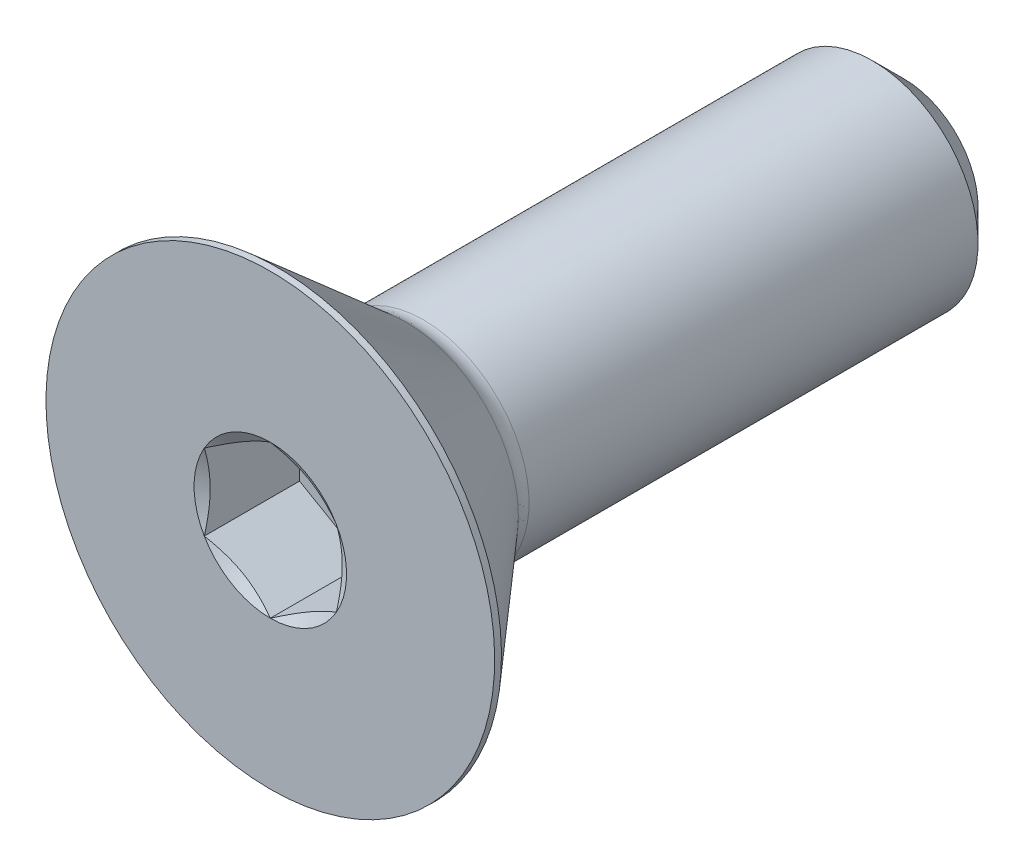
ISO-10303-21;
HEADER;
FILE_DESCRIPTION(('STEP AP214'),'2;1');
FILE_NAME('part.step','',(''),(''),'','','');
FILE_SCHEMA(('AUTOMOTIVE_DESIGN { 1 0 10303 214 1 1 1 1 }'));
ENDSEC;
DATA;
#1=APPLICATION_CONTEXT('core data for automotive mechanical design processes');
#2=APPLICATION_PROTOCOL_DEFINITION('international standard','automotive_design',2000,#1);
#3=PRODUCT_CONTEXT('',#1,'mechanical');
#4=PRODUCT('Part','Part','',(#3));
#5=PRODUCT_RELATED_PRODUCT_CATEGORY('part','',(#4));
#6=PRODUCT_DEFINITION_FORMATION('','',#4);
#7=PRODUCT_DEFINITION_CONTEXT('part definition',#1,'design');
#8=PRODUCT_DEFINITION('design','',#6,#7);
#9=PRODUCT_DEFINITION_SHAPE('','',#8);
#10=(LENGTH_UNIT() NAMED_UNIT(*) SI_UNIT(.MILLI.,.METRE.));
#11=(NAMED_UNIT(*) PLANE_ANGLE_UNIT() SI_UNIT($,.RADIAN.));
#12=(NAMED_UNIT(*) SI_UNIT($,.STERADIAN.) SOLID_ANGLE_UNIT());
#13=UNCERTAINTY_MEASURE_WITH_UNIT(LENGTH_MEASURE(1.E-05),#10,'distance_accuracy_value','');
#14=(GEOMETRIC_REPRESENTATION_CONTEXT(3) GLOBAL_UNCERTAINTY_ASSIGNED_CONTEXT((#13)) GLOBAL_UNIT_ASSIGNED_CONTEXT((#10,
#11,#12)) REPRESENTATION_CONTEXT('',''));
#15=CARTESIAN_POINT('',(0.,0.,0.));
#16=DIRECTION('',(0.,0.,1.));
#17=DIRECTION('',(1.,0.,0.));
#18=AXIS2_PLACEMENT_3D('',#15,#16,#17);
#19=CARTESIAN_POINT('',(0.,0.,-19.05));
#20=DIRECTION('',(0.,0.,-1.));
#21=DIRECTION('',(0.,1.,0.));
#22=AXIS2_PLACEMENT_3D('',#19,#20,#21);
#23=CYLINDRICAL_SURFACE('',#22,3.175);
#24=CARTESIAN_POINT('',(0.,0.,-18.0975));
#25=DIRECTION('',(0.,0.,-1.));
#26=DIRECTION('',(0.,1.,0.));
#27=AXIS2_PLACEMENT_3D('',#24,#25,#26);
#28=CIRCLE('',#27,3.175);
#29=CARTESIAN_POINT('',(0.,3.175,-18.0975));
#30=VERTEX_POINT('',#29);
#31=EDGE_CURVE('E50',#30,#30,#28,.F.);
#32=ORIENTED_EDGE('',*,*,#31,.T.);
#33=EDGE_LOOP('',(#32));
#34=FACE_BOUND('',#33,.T.);
#35=CARTESIAN_POINT('',(0.,0.,-4.60180899712602));
#36=DIRECTION('',(0.,0.,1.));
#37=DIRECTION('',(0.,-1.,0.));
#38=AXIS2_PLACEMENT_3D('',#35,#36,#37);
#39=CIRCLE('',#38,3.175);
#40=CARTESIAN_POINT('',(0.,-3.175,-4.60180899712602));
#41=VERTEX_POINT('',#40);
#42=EDGE_CURVE('E213',#41,#41,#39,.T.);
#43=ORIENTED_EDGE('',*,*,#42,.F.);
#44=EDGE_LOOP('',(#43));
#45=FACE_BOUND('',#44,.T.);
#46=ADVANCED_FACE('F36',(#34,#45),#23,.T.);
#47=CARTESIAN_POINT('',(0.,-3.175,-19.05));
#48=DIRECTION('',(0.,0.,-1.));
#49=DIRECTION('',(0.,1.,0.));
#50=AXIS2_PLACEMENT_3D('',#47,#48,#49);
#51=PLANE('',#50);
#52=CARTESIAN_POINT('',(0.,0.,-19.05));
#53=DIRECTION('',(0.,0.,-1.));
#54=DIRECTION('',(0.,1.,0.));
#55=AXIS2_PLACEMENT_3D('',#52,#53,#54);
#56=CIRCLE('',#55,2.2225);
#57=CARTESIAN_POINT('',(0.,2.2225,-19.05));
#58=VERTEX_POINT('',#57);
#59=EDGE_CURVE('E216',#58,#58,#56,.T.);
#60=ORIENTED_EDGE('',*,*,#59,.T.);
#61=EDGE_LOOP('',(#60));
#62=FACE_BOUND('',#61,.T.);
#63=ADVANCED_FACE('F226',(#62),#51,.T.);
#64=CARTESIAN_POINT('',(0.,0.,-19.05));
#65=DIRECTION('',(0.,0.,1.));
#66=DIRECTION('',(0.,-1.,0.));
#67=AXIS2_PLACEMENT_3D('',#64,#65,#66);
#68=CONICAL_SURFACE('',#67,2.2225,0.785398163397445);
#69=ORIENTED_EDGE('',*,*,#31,.F.);
#70=EDGE_LOOP('',(#69));
#71=FACE_BOUND('',#70,.T.);
#72=ORIENTED_EDGE('',*,*,#59,.F.);
#73=EDGE_LOOP('',(#72));
#74=FACE_BOUND('',#73,.T.);
#75=ADVANCED_FACE('F38',(#71,#74),#68,.T.);
#76=CARTESIAN_POINT('',(0.,0.,-4.60180899712602));
#77=DIRECTION('',(0.,0.,1.));
#78=DIRECTION('',(0.,-1.,0.));
#79=AXIS2_PLACEMENT_3D('',#76,#77,#78);
#80=TOROIDAL_SURFACE('',#79,3.95604099552517,0.781040995525163);
#81=CARTESIAN_POINT('',(0.,0.,-4.0894));
#82=DIRECTION('',(0.,0.,1.));
#83=DIRECTION('',(0.,-1.,0.));
#84=AXIS2_PLACEMENT_3D('',#81,#82,#83);
#85=CIRCLE('',#84,3.36658187365559);
#86=CARTESIAN_POINT('',(0.,-3.36658187365559,-4.0894));
#87=VERTEX_POINT('',#86);
#88=EDGE_CURVE('E210',#87,#87,#85,.T.);
#89=ORIENTED_EDGE('',*,*,#88,.F.);
#90=EDGE_LOOP('',(#89));
#91=FACE_BOUND('',#90,.T.);
#92=ORIENTED_EDGE('',*,*,#42,.T.);
#93=EDGE_LOOP('',(#92));
#94=FACE_BOUND('',#93,.T.);
#95=ADVANCED_FACE('F225',(#91,#94),#80,.F.);
#96=CARTESIAN_POINT('',(0.,0.,-4.0894));
#97=DIRECTION('',(0.,0.,1.));
#98=DIRECTION('',(0.,-1.,0.));
#99=AXIS2_PLACEMENT_3D('',#96,#97,#98);
#100=CONICAL_SURFACE('',#99,3.36658187365559,0.715584993317677);
#101=CARTESIAN_POINT('',(0.,0.,-0.204469999999999));
#102=DIRECTION('',(0.,0.,1.));
#103=DIRECTION('',(0.,-1.,0.));
#104=AXIS2_PLACEMENT_3D('',#101,#102,#103);
#105=CIRCLE('',#104,6.7437);
#106=CARTESIAN_POINT('',(0.,-6.7437,-0.204469999999999));
#107=VERTEX_POINT('',#106);
#108=EDGE_CURVE('E207',#107,#107,#105,.T.);
#109=ORIENTED_EDGE('',*,*,#108,.F.);
#110=EDGE_LOOP('',(#109));
#111=FACE_BOUND('',#110,.T.);
#112=ORIENTED_EDGE('',*,*,#88,.T.);
#113=EDGE_LOOP('',(#112));
#114=FACE_BOUND('',#113,.T.);
#115=ADVANCED_FACE('F238',(#111,#114),#100,.T.);
#116=CARTESIAN_POINT('',(0.,0.,0.));
#117=DIRECTION('',(0.,0.,1.));
#118=DIRECTION('',(0.,-1.,0.));
#119=AXIS2_PLACEMENT_3D('',#116,#117,#118);
#120=CYLINDRICAL_SURFACE('',#119,6.7437);
#121=CARTESIAN_POINT('',(0.,0.,0.));
#122=DIRECTION('',(0.,0.,1.));
#123=DIRECTION('',(0.,-1.,0.));
#124=AXIS2_PLACEMENT_3D('',#121,#122,#123);
#125=CIRCLE('',#124,6.7437);
#126=CARTESIAN_POINT('',(0.,-6.7437,0.));
#127=VERTEX_POINT('',#126);
#128=EDGE_CURVE('E195',#127,#127,#125,.T.);
#129=ORIENTED_EDGE('',*,*,#128,.F.);
#130=EDGE_LOOP('',(#129));
#131=FACE_BOUND('',#130,.T.);
#132=ORIENTED_EDGE('',*,*,#108,.T.);
#133=EDGE_LOOP('',(#132));
#134=FACE_BOUND('',#133,.T.);
#135=ADVANCED_FACE('F168',(#131,#134),#120,.T.);
#136=CARTESIAN_POINT('',(0.,-3.175,0.));
#137=DIRECTION('',(0.,0.,1.));
#138=DIRECTION('',(0.,-1.,0.));
#139=AXIS2_PLACEMENT_3D('',#136,#137,#138);
#140=PLANE('',#139);
#141=CARTESIAN_POINT('',(0.,0.,0.));
#142=DIRECTION('',(0.,0.,1.));
#143=DIRECTION('',(1.,0.,0.));
#144=AXIS2_PLACEMENT_3D('',#141,#142,#143);
#145=CIRCLE('',#144,2.29135888084633);
#146=CARTESIAN_POINT('',(0.,-2.29135888084633,0.));
#147=VERTEX_POINT('',#146);
#148=CARTESIAN_POINT('',(1.984375,-1.14567944042316,0.));
#149=VERTEX_POINT('',#148);
#150=EDGE_CURVE('E63',#147,#149,#145,.T.);
#151=ORIENTED_EDGE('',*,*,#150,.F.);
#152=CARTESIAN_POINT('',(-1.984375,-1.14567944042316,0.));
#153=VERTEX_POINT('',#152);
#154=EDGE_CURVE('E135',#153,#147,#145,.T.);
#155=ORIENTED_EDGE('',*,*,#154,.F.);
#156=CARTESIAN_POINT('',(-1.984375,1.14567944042317,0.));
#157=VERTEX_POINT('',#156);
#158=EDGE_CURVE('E134',#157,#153,#145,.T.);
#159=ORIENTED_EDGE('',*,*,#158,.F.);
#160=CARTESIAN_POINT('',(0.,2.29135888084633,0.));
#161=VERTEX_POINT('',#160);
#162=EDGE_CURVE('E104',#161,#157,#145,.T.);
#163=ORIENTED_EDGE('',*,*,#162,.F.);
#164=CARTESIAN_POINT('',(1.984375,1.14567944042316,0.));
#165=VERTEX_POINT('',#164);
#166=EDGE_CURVE('E95',#165,#161,#145,.T.);
#167=ORIENTED_EDGE('',*,*,#166,.F.);
#168=EDGE_CURVE('E56',#149,#165,#145,.T.);
#169=ORIENTED_EDGE('',*,*,#168,.F.);
#170=EDGE_LOOP('',(#151,#155,#159,#163,#167,#169));
#171=FACE_BOUND('',#170,.T.);
#172=ORIENTED_EDGE('',*,*,#128,.T.);
#173=EDGE_LOOP('',(#172));
#174=FACE_BOUND('',#173,.T.);
#175=ADVANCED_FACE('F130',(#171,#174),#140,.T.);
#176=CARTESIAN_POINT('',(0.,0.,0.));
#177=DIRECTION('',(0.,0.,1.));
#178=DIRECTION('',(1.,0.,0.));
#179=AXIS2_PLACEMENT_3D('',#176,#177,#178);
#180=CONICAL_SURFACE('',#179,2.29135888084633,1.0471975511966);
#181=ORIENTED_EDGE('',*,*,#162,.T.);
#182=CARTESIAN_POINT('',(0.000199999999999609,2.29147435090017,6.66717057831416E-05));
#183=CARTESIAN_POINT('',(-0.0870046387806768,2.24112672922556,-0.029014317759813));
#184=CARTESIAN_POINT('',(-0.174962019304997,2.19034451190263,-0.0554627919729485));
#185=CARTESIAN_POINT('',(-0.35239997867232,2.08790065829745,-0.101629728793529));
#186=CARTESIAN_POINT('',(-0.441883711256319,2.03623720120198,-0.121331857751036));
#187=CARTESIAN_POINT('',(-0.619742148012469,1.93355058486317,-0.152002268068471));
#188=CARTESIAN_POINT('',(-0.708089480306094,1.88254322878126,-0.163174657279787));
#189=CARTESIAN_POINT('',(-0.88520002811095,1.78028840632981,-0.176514203945575));
#190=CARTESIAN_POINT('',(-0.973962599510547,1.72904131183829,-0.178692405539878));
#191=CARTESIAN_POINT('',(-1.13983230286466,1.63327639395638,-0.174170448491651));
#192=CARTESIAN_POINT('',(-1.21696421566591,1.58874426333747,-0.168580586544127));
#193=CARTESIAN_POINT('',(-1.37072550718908,1.49997014028563,-0.150861066102989));
#194=CARTESIAN_POINT('',(-1.44735435374552,1.45572845509857,-0.138725349670475));
#195=CARTESIAN_POINT('',(-1.60143288850678,1.36677117157782,-0.108385841155635));
#196=CARTESIAN_POINT('',(-1.67886306721268,1.32206683705857,-0.09005339070901));
#197=CARTESIAN_POINT('',(-1.83256831124359,1.23332507304146,-0.0484454935998176));
#198=CARTESIAN_POINT('',(-1.90884534705293,1.18928650588395,-0.0251798287176209));
#199=CARTESIAN_POINT('',(-1.984575,1.14556397036933,6.66717057829762E-05));
#200=B_SPLINE_CURVE_WITH_KNOTS('',3,(#182,#183,#184,#185,#186,#187,#188,#189,#190,#191,#192,
#193,#194,#195,#196,#197,#198,#199),.UNSPECIFIED.,.F.,.F.,(4,2,2,2,2,2,2,2,4),(0.,
0.314555137114086,0.629866549668806,0.937373439505933,1.24450262309398,1.51196650590478,
1.77967834211415,2.05332989762155,2.32644383656793),.UNSPECIFIED.);
#201=EDGE_CURVE('E11',#161,#157,#200,.T.);
#202=ORIENTED_EDGE('',*,*,#201,.F.);
#203=EDGE_LOOP('',(#181,#202));
#204=FACE_BOUND('',#203,.T.);
#205=ADVANCED_FACE('F108',(#204),#180,.F.);
#206=ORIENTED_EDGE('',*,*,#158,.T.);
#207=CARTESIAN_POINT('',(-1.984375,-2.96692860034507,0.737860651092377));
#208=CARTESIAN_POINT('',(-1.984375,-2.88123645369667,0.69674880177529));
#209=CARTESIAN_POINT('',(-1.984375,-2.79533554929687,0.656063972956056));
#210=CARTESIAN_POINT('',(-1.984375,-2.62300496253372,0.575790597945192));
#211=CARTESIAN_POINT('',(-1.984375,-2.53657518838115,0.536202249047077));
#212=CARTESIAN_POINT('',(-1.984375,-2.36258003650985,0.458142914429596));
#213=CARTESIAN_POINT('',(-1.984375,-2.27501095051754,0.419680163398946));
#214=CARTESIAN_POINT('',(-1.984375,-2.09913795632987,0.344479427097519));
#215=CARTESIAN_POINT('',(-1.984375,-2.01083408662377,0.307741352146445));
#216=CARTESIAN_POINT('',(-1.984375,-1.83102497893539,0.235513729354963));
#217=CARTESIAN_POINT('',(-1.984375,-1.73949640320228,0.200081939073892));
#218=CARTESIAN_POINT('',(-1.984375,-1.55533214713673,0.132164183556778));
#219=CARTESIAN_POINT('',(-1.984375,-1.46269633980312,0.0996785599926462));
#220=CARTESIAN_POINT('',(-1.984375,-1.27638419434466,0.0385821363592113));
#221=CARTESIAN_POINT('',(-1.984375,-1.18271082678456,0.00996237523819853));
#222=CARTESIAN_POINT('',(-1.984375,-0.994021652382587,-0.0424236311394211));
#223=CARTESIAN_POINT('',(-1.984375,-0.899006185229732,-0.0661910818015453));
#224=CARTESIAN_POINT('',(-1.984375,-0.70783051245842,-0.107605260619429));
#225=CARTESIAN_POINT('',(-1.984375,-0.611673084373239,-0.125264559933971));
#226=CARTESIAN_POINT('',(-1.984375,-0.418283092113672,-0.153306903466505));
#227=CARTESIAN_POINT('',(-1.984375,-0.32105060104525,-0.163690439394072));
#228=CARTESIAN_POINT('',(-1.984375,-0.127210752774483,-0.176214799009401));
#229=CARTESIAN_POINT('',(-1.984375,-0.0306098639781231,-0.178452892631436));
#230=CARTESIAN_POINT('',(-1.984375,0.162431915887106,-0.17475795296783));
#231=CARTESIAN_POINT('',(-1.984375,0.258872796678698,-0.168824413724938));
#232=CARTESIAN_POINT('',(-1.984375,0.496826477184735,-0.144624426308478));
#233=CARTESIAN_POINT('',(-1.984375,0.637878211825128,-0.121822779785831));
#234=CARTESIAN_POINT('',(-1.984375,0.91723870370253,-0.0630239757386336));
#235=CARTESIAN_POINT('',(-1.984375,1.05554394232965,-0.0270109144574765));
#236=CARTESIAN_POINT('',(-1.984375,1.26239464896717,0.0345082078903479));
#237=CARTESIAN_POINT('',(-1.984375,1.33200934564274,0.0565514264145546));
#238=CARTESIAN_POINT('',(-1.984375,1.47051409380588,0.102676986257499));
#239=CARTESIAN_POINT('',(-1.984375,1.53940456776433,0.126758055006123));
#240=CARTESIAN_POINT('',(-1.984375,1.67655293465251,0.176609588689456));
#241=CARTESIAN_POINT('',(-1.984375,1.74481093998431,0.202379746602285));
#242=CARTESIAN_POINT('',(-1.984375,1.88078910071683,0.255330712681564));
#243=CARTESIAN_POINT('',(-1.984375,1.94850916300286,0.282511759182964));
#244=CARTESIAN_POINT('',(-1.984375,2.12136731788458,0.353633623835928));
#245=CARTESIAN_POINT('',(-1.984375,2.22615977384556,0.398413596701326));
#246=CARTESIAN_POINT('',(-1.984375,2.43479837304527,0.490132195682473));
#247=CARTESIAN_POINT('',(-1.984375,2.5386444446916,0.537070983511256));
#248=CARTESIAN_POINT('',(-1.984375,2.84907841644385,0.680364561323518));
#249=CARTESIAN_POINT('',(-1.984375,3.05452739791262,0.77918187526435));
#250=CARTESIAN_POINT('',(-1.984375,3.46367014223902,0.980960885724764));
#251=CARTESIAN_POINT('',(-1.984375,3.66736143684958,1.08392752775299));
#252=CARTESIAN_POINT('',(-1.984375,4.07334844866211,1.29250841655482));
#253=CARTESIAN_POINT('',(-1.984375,4.27564433912763,1.39812232679349));
#254=CARTESIAN_POINT('',(-1.984375,4.66022184962415,1.60111933686162));
#255=CARTESIAN_POINT('',(-1.984375,4.84259034249047,1.69833842729249));
#256=CARTESIAN_POINT('',(-1.984375,5.20674070245669,1.89388432048827));
#257=CARTESIAN_POINT('',(-1.984375,5.38852254752481,1.99221116424656));
#258=CARTESIAN_POINT('',(-1.984375,5.75117247931181,2.18944361750704));
#259=CARTESIAN_POINT('',(-1.984375,5.93204171415673,2.2883471187779));
#260=CARTESIAN_POINT('',(-1.984375,6.29341450955436,2.48679783989033));
#261=CARTESIAN_POINT('',(-1.984375,6.47391808874828,2.5863450257738));
#262=CARTESIAN_POINT('',(-1.984375,6.6542902961452,2.6861282522634));
#263=B_SPLINE_CURVE_WITH_KNOTS('',3,(#207,#208,#209,#210,#211,#212,#213,#214,#215,#216,#217,
#218,#219,#220,#221,#222,#223,#224,#225,#226,#227,#228,#229,#230,#231,#232,#233,#234,#235,#236,
#237,#238,#239,#240,#241,#242,#243,#244,#245,#246,#247,#248,#249,#250,#251,#252,#253,#254,#255,
#256,#257,#258,#259,#260,#261,#262),.UNSPECIFIED.,.F.,.F.,(4,2,2,2,2,2,2,2,2,2,2,2,2,2,2,2,2,2,
2,2,2,2,2,2,2,2,2,4),(0.,0.285135519832373,0.570322016122788,0.857238463819792,1.14413997577449,
1.43854271801315,1.7329795590899,2.02672173491208,2.32039085060263,2.61345191984504,
2.90649318156653,3.19602335108128,3.48557144803805,3.91334047285799,4.34162614021154,
4.56066589824458,4.77956986852721,4.99843415889189,5.21733554208811,5.55917796423187,
5.90104603503021,6.58489509249957,7.26958483186157,7.95418796687477,8.57417425374278,
9.1941835596094,9.81261585701217,10.431015790458),.UNSPECIFIED.);
#264=EDGE_CURVE('E103',#157,#153,#263,.F.);
#265=ORIENTED_EDGE('',*,*,#264,.F.);
#266=EDGE_LOOP('',(#206,#265));
#267=FACE_BOUND('',#266,.T.);
#268=ADVANCED_FACE('F266',(#267),#180,.F.);
#269=ORIENTED_EDGE('',*,*,#154,.T.);
#270=CARTESIAN_POINT('',(-1.984575,-1.14556397036933,6.66717057829649E-05));
#271=CARTESIAN_POINT('',(-1.89737036121932,-1.19591159204393,-0.0290143177598132));
#272=CARTESIAN_POINT('',(-1.809412980695,-1.24669380936686,-0.0554627919729487));
#273=CARTESIAN_POINT('',(-1.63197502132768,-1.34913766297205,-0.101629728793529));
#274=CARTESIAN_POINT('',(-1.54249128874368,-1.40080112006751,-0.121331857751037));
#275=CARTESIAN_POINT('',(-1.36463285198753,-1.50348773640632,-0.152002268068471));
#276=CARTESIAN_POINT('',(-1.27628551969391,-1.55449509248823,-0.163174657279787));
#277=CARTESIAN_POINT('',(-1.09917497188905,-1.65674991493968,-0.176514203945575));
#278=CARTESIAN_POINT('',(-1.01041240048945,-1.70799700943121,-0.178692405539878));
#279=CARTESIAN_POINT('',(-0.844542697135338,-1.80376192731311,-0.174170448491652));
#280=CARTESIAN_POINT('',(-0.767410784334093,-1.84829405793202,-0.168580586544128));
#281=CARTESIAN_POINT('',(-0.613649492810919,-1.93706818098387,-0.150861066102989));
#282=CARTESIAN_POINT('',(-0.537020646254476,-1.98130986617092,-0.138725349670476));
#283=CARTESIAN_POINT('',(-0.382942111493217,-2.07026714969167,-0.108385841155636));
#284=CARTESIAN_POINT('',(-0.305511932787318,-2.11497148421093,-0.0900533907090107));
#285=CARTESIAN_POINT('',(-0.151806688756412,-2.20371324822803,-0.0484454935998183));
#286=CARTESIAN_POINT('',(-0.075529652947068,-2.24775181538554,-0.0251798287176216));
#287=CARTESIAN_POINT('',(0.000199999999999772,-2.29147435090016,6.66717057822253E-05));
#288=B_SPLINE_CURVE_WITH_KNOTS('',3,(#270,#271,#272,#273,#274,#275,#276,#277,#278,#279,#280,
#281,#282,#283,#284,#285,#286,#287),.UNSPECIFIED.,.F.,.F.,(4,2,2,2,2,2,2,2,4),(0.,
0.314555137114086,0.629866549668806,0.937373439505932,1.24450262309398,1.51196650590478,
1.77967834211415,2.05332989762155,2.32644383656793),.UNSPECIFIED.);
#289=EDGE_CURVE('E144',#153,#147,#288,.T.);
#290=ORIENTED_EDGE('',*,*,#289,.F.);
#291=EDGE_LOOP('',(#269,#290));
#292=FACE_BOUND('',#291,.T.);
#293=ADVANCED_FACE('F272',(#292),#180,.F.);
#294=ORIENTED_EDGE('',*,*,#150,.T.);
#295=CARTESIAN_POINT('',(-0.000200000000000051,-2.29147435090016,6.66717057826408E-05));
#296=CARTESIAN_POINT('',(0.0870046387806763,-2.24112672922556,-0.0290143177598132));
#297=CARTESIAN_POINT('',(0.174962019304996,-2.19034451190263,-0.0554627919729487));
#298=CARTESIAN_POINT('',(0.352399978672319,-2.08790065829744,-0.101629728793529));
#299=CARTESIAN_POINT('',(0.441883711256319,-2.03623720120198,-0.121331857751037));
#300=CARTESIAN_POINT('',(0.619742148012468,-1.93355058486317,-0.152002268068471));
#301=CARTESIAN_POINT('',(0.708089480306093,-1.88254322878126,-0.163174657279787));
#302=CARTESIAN_POINT('',(0.885200028110949,-1.78028840632981,-0.176514203945575));
#303=CARTESIAN_POINT('',(0.973962599510546,-1.72904131183829,-0.178692405539878));
#304=CARTESIAN_POINT('',(1.13983230286466,-1.63327639395638,-0.174170448491652));
#305=CARTESIAN_POINT('',(1.21696421566591,-1.58874426333747,-0.168580586544128));
#306=CARTESIAN_POINT('',(1.37072550718908,-1.49997014028563,-0.150861066102989));
#307=CARTESIAN_POINT('',(1.44735435374552,-1.45572845509857,-0.138725349670476));
#308=CARTESIAN_POINT('',(1.60143288850678,-1.36677117157782,-0.108385841155636));
#309=CARTESIAN_POINT('',(1.67886306721268,-1.32206683705856,-0.0900533907090105));
#310=CARTESIAN_POINT('',(1.83256831124359,-1.23332507304146,-0.0484454935998179));
#311=CARTESIAN_POINT('',(1.90884534705293,-1.18928650588395,-0.0251798287176211));
#312=CARTESIAN_POINT('',(1.984575,-1.14556397036933,6.66717057827258E-05));
#313=B_SPLINE_CURVE_WITH_KNOTS('',3,(#295,#296,#297,#298,#299,#300,#301,#302,#303,#304,#305,
#306,#307,#308,#309,#310,#311,#312),.UNSPECIFIED.,.F.,.F.,(4,2,2,2,2,2,2,2,4),(0.,
0.314555137114085,0.629866549668806,0.937373439505932,1.24450262309398,1.51196650590478,
1.77967834211415,2.05332989762155,2.32644383656793),.UNSPECIFIED.);
#314=EDGE_CURVE('E395',#147,#149,#313,.T.);
#315=ORIENTED_EDGE('',*,*,#314,.F.);
#316=EDGE_LOOP('',(#294,#315));
#317=FACE_BOUND('',#316,.T.);
#318=ADVANCED_FACE('F279',(#317),#180,.F.);
#319=ORIENTED_EDGE('',*,*,#168,.T.);
#320=CARTESIAN_POINT('',(1.984375,-2.96692860034507,0.737860651092378));
#321=CARTESIAN_POINT('',(1.984375,-2.88123645369666,0.69674880177529));
#322=CARTESIAN_POINT('',(1.984375,-2.79533554929687,0.656063972956056));
#323=CARTESIAN_POINT('',(1.984375,-2.62300496253372,0.575790597945192));
#324=CARTESIAN_POINT('',(1.984375,-2.53657518838115,0.536202249047077));
#325=CARTESIAN_POINT('',(1.984375,-2.36258003650985,0.458142914429596));
#326=CARTESIAN_POINT('',(1.984375,-2.27501095051754,0.419680163398946));
#327=CARTESIAN_POINT('',(1.984375,-2.09913795632987,0.344479427097519));
#328=CARTESIAN_POINT('',(1.984375,-2.01083408662377,0.307741352146445));
#329=CARTESIAN_POINT('',(1.984375,-1.83102497893539,0.235513729354964));
#330=CARTESIAN_POINT('',(1.984375,-1.73949640320228,0.200081939073892));
#331=CARTESIAN_POINT('',(1.984375,-1.55533214713673,0.132164183556778));
#332=CARTESIAN_POINT('',(1.984375,-1.46269633980312,0.0996785599926464));
#333=CARTESIAN_POINT('',(1.984375,-1.27638419434466,0.0385821363592116));
#334=CARTESIAN_POINT('',(1.984375,-1.18271082678456,0.00996237523819882));
#335=CARTESIAN_POINT('',(1.984375,-0.994021652382587,-0.042423631139421));
#336=CARTESIAN_POINT('',(1.984375,-0.899006185229731,-0.0661910818015453));
#337=CARTESIAN_POINT('',(1.984375,-0.70783051245842,-0.107605260619429));
#338=CARTESIAN_POINT('',(1.984375,-0.611673084373239,-0.125264559933971));
#339=CARTESIAN_POINT('',(1.984375,-0.418283092113671,-0.153306903466505));
#340=CARTESIAN_POINT('',(1.984375,-0.32105060104525,-0.163690439394072));
#341=CARTESIAN_POINT('',(1.984375,-0.127210752774482,-0.176214799009401));
#342=CARTESIAN_POINT('',(1.984375,-0.0306098639781227,-0.178452892631436));
#343=CARTESIAN_POINT('',(1.984375,0.162431915887107,-0.17475795296783));
#344=CARTESIAN_POINT('',(1.984375,0.258872796678699,-0.168824413724938));
#345=CARTESIAN_POINT('',(1.984375,0.496826477184735,-0.144624426308478));
#346=CARTESIAN_POINT('',(1.984375,0.637878211825129,-0.12182277978583));
#347=CARTESIAN_POINT('',(1.984375,0.91723870370253,-0.0630239757386333));
#348=CARTESIAN_POINT('',(1.984375,1.05554394232965,-0.0270109144574763));
#349=CARTESIAN_POINT('',(1.984375,1.26239464896717,0.0345082078903483));
#350=CARTESIAN_POINT('',(1.984375,1.33200934564274,0.0565514264145553));
#351=CARTESIAN_POINT('',(1.984375,1.47051409380588,0.1026769862575));
#352=CARTESIAN_POINT('',(1.984375,1.53940456776433,0.126758055006124));
#353=CARTESIAN_POINT('',(1.984375,1.67655293465251,0.176609588689457));
#354=CARTESIAN_POINT('',(1.984375,1.74481093998432,0.202379746602286));
#355=CARTESIAN_POINT('',(1.984375,1.88078910071683,0.255330712681565));
#356=CARTESIAN_POINT('',(1.984375,1.94850916300287,0.282511759182965));
#357=CARTESIAN_POINT('',(1.984375,2.12136731788458,0.353633623835929));
#358=CARTESIAN_POINT('',(1.984375,2.22615977384557,0.398413596701327));
#359=CARTESIAN_POINT('',(1.984375,2.43479837304527,0.490132195682473));
#360=CARTESIAN_POINT('',(1.984375,2.5386444446916,0.537070983511257));
#361=CARTESIAN_POINT('',(1.984375,2.84907841644385,0.680364561323519));
#362=CARTESIAN_POINT('',(1.984375,3.05452739791262,0.779181875264351));
#363=CARTESIAN_POINT('',(1.984375,3.46367014223902,0.980960885724765));
#364=CARTESIAN_POINT('',(1.984375,3.66736143684958,1.08392752775299));
#365=CARTESIAN_POINT('',(1.984375,4.07334844866211,1.29250841655482));
#366=CARTESIAN_POINT('',(1.984375,4.27564433912763,1.3981223267935));
#367=CARTESIAN_POINT('',(1.984375,4.66022184962416,1.60111933686162));
#368=CARTESIAN_POINT('',(1.984375,4.84259034249048,1.6983384272925));
#369=CARTESIAN_POINT('',(1.984375,5.2067407024567,1.89388432048827));
#370=CARTESIAN_POINT('',(1.984375,5.38852254752481,1.99221116424656));
#371=CARTESIAN_POINT('',(1.984375,5.75117247931181,2.18944361750704));
#372=CARTESIAN_POINT('',(1.984375,5.93204171415673,2.2883471187779));
#373=CARTESIAN_POINT('',(1.984375,6.29341450955436,2.48679783989034));
#374=CARTESIAN_POINT('',(1.984375,6.47391808874828,2.5863450257738));
#375=CARTESIAN_POINT('',(1.984375,6.6542902961452,2.6861282522634));
#376=B_SPLINE_CURVE_WITH_KNOTS('',3,(#320,#321,#322,#323,#324,#325,#326,#327,#328,#329,#330,
#331,#332,#333,#334,#335,#336,#337,#338,#339,#340,#341,#342,#343,#344,#345,#346,#347,#348,#349,
#350,#351,#352,#353,#354,#355,#356,#357,#358,#359,#360,#361,#362,#363,#364,#365,#366,#367,#368,
#369,#370,#371,#372,#373,#374,#375),.UNSPECIFIED.,.F.,.F.,(4,2,2,2,2,2,2,2,2,2,2,2,2,2,2,2,2,2,
2,2,2,2,2,2,2,2,2,4),(0.,0.285135519832374,0.570322016122787,0.857238463819791,1.14413997577449,
1.43854271801315,1.7329795590899,2.02672173491208,2.32039085060263,2.61345191984504,
2.90649318156653,3.19602335108128,3.48557144803805,3.91334047285799,4.34162614021154,
4.56066589824458,4.77956986852721,4.9984341588919,5.21733554208812,5.55917796423187,
5.90104603503021,6.58489509249957,7.26958483186157,7.95418796687478,8.57417425374278,
9.1941835596094,9.81261585701217,10.431015790458),.UNSPECIFIED.);
#377=EDGE_CURVE('E120',#149,#165,#376,.T.);
#378=ORIENTED_EDGE('',*,*,#377,.F.);
#379=EDGE_LOOP('',(#319,#378));
#380=FACE_BOUND('',#379,.T.);
#381=ADVANCED_FACE('F286',(#380),#180,.F.);
#382=ORIENTED_EDGE('',*,*,#166,.T.);
#383=CARTESIAN_POINT('',(1.984575,1.14556397036933,6.66717057832154E-05));
#384=CARTESIAN_POINT('',(1.89737036121932,1.19591159204393,-0.029014317759813));
#385=CARTESIAN_POINT('',(1.809412980695,1.24669380936687,-0.0554627919729485));
#386=CARTESIAN_POINT('',(1.63197502132768,1.34913766297205,-0.101629728793529));
#387=CARTESIAN_POINT('',(1.54249128874368,1.40080112006751,-0.121331857751036));
#388=CARTESIAN_POINT('',(1.36463285198753,1.50348773640632,-0.152002268068471));
#389=CARTESIAN_POINT('',(1.27628551969391,1.55449509248823,-0.163174657279786));
#390=CARTESIAN_POINT('',(1.09917497188905,1.65674991493969,-0.176514203945575));
#391=CARTESIAN_POINT('',(1.01041240048945,1.70799700943121,-0.178692405539878));
#392=CARTESIAN_POINT('',(0.844542697135338,1.80376192731311,-0.174170448491651));
#393=CARTESIAN_POINT('',(0.767410784334093,1.84829405793202,-0.168580586544127));
#394=CARTESIAN_POINT('',(0.613649492810919,1.93706818098387,-0.150861066102989));
#395=CARTESIAN_POINT('',(0.537020646254476,1.98130986617092,-0.138725349670475));
#396=CARTESIAN_POINT('',(0.382942111493217,2.07026714969167,-0.108385841155635));
#397=CARTESIAN_POINT('',(0.305511932787317,2.11497148421093,-0.0900533907090102));
#398=CARTESIAN_POINT('',(0.151806688756411,2.20371324822803,-0.0484454935998178));
#399=CARTESIAN_POINT('',(0.0755296529470672,2.24775181538554,-0.0251798287176211));
#400=CARTESIAN_POINT('',(-0.000200000000000537,2.29147435090017,6.6671705782726E-05));
#401=B_SPLINE_CURVE_WITH_KNOTS('',3,(#383,#384,#385,#386,#387,#388,#389,#390,#391,#392,#393,
#394,#395,#396,#397,#398,#399,#400),.UNSPECIFIED.,.F.,.F.,(4,2,2,2,2,2,2,2,4),(0.,
0.314555137114086,0.629866549668806,0.937373439505933,1.24450262309398,1.51196650590478,
1.77967834211415,2.05332989762155,2.32644383656793),.UNSPECIFIED.);
#402=EDGE_CURVE('E99',#165,#161,#401,.T.);
#403=ORIENTED_EDGE('',*,*,#402,.F.);
#404=EDGE_LOOP('',(#382,#403));
#405=FACE_BOUND('',#404,.T.);
#406=ADVANCED_FACE('F97',(#405),#180,.F.);
#407=CARTESIAN_POINT('',(0.,2.29135888084633,-2.86258));
#408=DIRECTION('',(0.,0.,1.));
#409=DIRECTION('',(1.,0.,0.));
#410=AXIS2_PLACEMENT_3D('',#407,#408,#409);
#411=PLANE('',#410);
#412=DIRECTION('',(-0.866025403784439,0.5,0.));
#413=VECTOR('',#412,1.);
#414=CARTESIAN_POINT('',(1.984375,1.14567944042317,-2.86258));
#415=LINE('',#414,#413);
#416=CARTESIAN_POINT('',(1.984375,1.14567944042317,-2.86258));
#417=VERTEX_POINT('',#416);
#418=CARTESIAN_POINT('',(0.,2.29135888084633,-2.86258));
#419=VERTEX_POINT('',#418);
#420=EDGE_CURVE('E119',#417,#419,#415,.T.);
#421=ORIENTED_EDGE('',*,*,#420,.T.);
#422=DIRECTION('',(-0.866025403784439,-0.5,0.));
#423=VECTOR('',#422,1.);
#424=CARTESIAN_POINT('',(0.,2.29135888084633,-2.86258));
#425=LINE('',#424,#423);
#426=CARTESIAN_POINT('',(-1.984375,1.14567944042316,-2.86258));
#427=VERTEX_POINT('',#426);
#428=EDGE_CURVE('E124',#419,#427,#425,.T.);
#429=ORIENTED_EDGE('',*,*,#428,.T.);
#430=DIRECTION('',(0.,-1.,0.));
#431=VECTOR('',#430,1.);
#432=CARTESIAN_POINT('',(-1.984375,1.14567944042316,-2.86258));
#433=LINE('',#432,#431);
#434=CARTESIAN_POINT('',(-1.984375,-1.14567944042316,-2.86258));
#435=VERTEX_POINT('',#434);
#436=EDGE_CURVE('E183',#427,#435,#433,.T.);
#437=ORIENTED_EDGE('',*,*,#436,.T.);
#438=DIRECTION('',(0.866025403784439,-0.5,0.));
#439=VECTOR('',#438,1.);
#440=CARTESIAN_POINT('',(-1.984375,-1.14567944042316,-2.86258));
#441=LINE('',#440,#439);
#442=CARTESIAN_POINT('',(0.,-2.29135888084633,-2.86258));
#443=VERTEX_POINT('',#442);
#444=EDGE_CURVE('E186',#435,#443,#441,.T.);
#445=ORIENTED_EDGE('',*,*,#444,.T.);
#446=DIRECTION('',(0.866025403784439,0.5,0.));
#447=VECTOR('',#446,1.);
#448=CARTESIAN_POINT('',(0.,-2.29135888084633,-2.86258));
#449=LINE('',#448,#447);
#450=CARTESIAN_POINT('',(1.984375,-1.14567944042316,-2.86258));
#451=VERTEX_POINT('',#450);
#452=EDGE_CURVE('E189',#443,#451,#449,.T.);
#453=ORIENTED_EDGE('',*,*,#452,.T.);
#454=DIRECTION('',(0.,1.,0.));
#455=VECTOR('',#454,1.);
#456=CARTESIAN_POINT('',(1.984375,-1.14567944042316,-2.86258));
#457=LINE('',#456,#455);
#458=EDGE_CURVE('E127',#451,#417,#457,.T.);
#459=ORIENTED_EDGE('',*,*,#458,.T.);
#460=EDGE_LOOP('',(#421,#429,#437,#445,#453,#459));
#461=FACE_BOUND('',#460,.T.);
#462=ADVANCED_FACE('F163',(#461),#411,.T.);
#463=CARTESIAN_POINT('',(0.,2.29135888084633,-2.86258));
#464=DIRECTION('',(-0.5,0.866025403784439,0.));
#465=DIRECTION('',(-0.866025403784439,-0.5,0.));
#466=AXIS2_PLACEMENT_3D('',#463,#464,#465);
#467=PLANE('',#466);
#468=DIRECTION('',(0.,0.,1.));
#469=VECTOR('',#468,1.);
#470=CARTESIAN_POINT('',(0.,2.29135888084633,-2.86258));
#471=LINE('',#470,#469);
#472=EDGE_CURVE('E116',#419,#161,#471,.T.);
#473=ORIENTED_EDGE('',*,*,#472,.T.);
#474=ORIENTED_EDGE('',*,*,#201,.T.);
#475=DIRECTION('',(0.,0.,1.));
#476=VECTOR('',#475,1.);
#477=CARTESIAN_POINT('',(-1.984375,1.14567944042316,-2.86258));
#478=LINE('',#477,#476);
#479=EDGE_CURVE('E126',#427,#157,#478,.T.);
#480=ORIENTED_EDGE('',*,*,#479,.F.);
#481=ORIENTED_EDGE('',*,*,#428,.F.);
#482=EDGE_LOOP('',(#473,#474,#480,#481));
#483=FACE_BOUND('',#482,.T.);
#484=ADVANCED_FACE('F122',(#483),#467,.F.);
#485=CARTESIAN_POINT('',(-1.984375,1.14567944042316,-2.86258));
#486=DIRECTION('',(-1.,0.,0.));
#487=DIRECTION('',(0.,-1.,0.));
#488=AXIS2_PLACEMENT_3D('',#485,#486,#487);
#489=PLANE('',#488);
#490=ORIENTED_EDGE('',*,*,#479,.T.);
#491=ORIENTED_EDGE('',*,*,#264,.T.);
#492=DIRECTION('',(0.,0.,1.));
#493=VECTOR('',#492,1.);
#494=CARTESIAN_POINT('',(-1.984375,-1.14567944042316,-2.86258));
#495=LINE('',#494,#493);
#496=EDGE_CURVE('E202',#435,#153,#495,.T.);
#497=ORIENTED_EDGE('',*,*,#496,.F.);
#498=ORIENTED_EDGE('',*,*,#436,.F.);
#499=EDGE_LOOP('',(#490,#491,#497,#498));
#500=FACE_BOUND('',#499,.T.);
#501=ADVANCED_FACE('F153',(#500),#489,.F.);
#502=CARTESIAN_POINT('',(-1.984375,-1.14567944042316,-2.86258));
#503=DIRECTION('',(-0.5,-0.866025403784439,0.));
#504=DIRECTION('',(0.866025403784439,-0.5,0.));
#505=AXIS2_PLACEMENT_3D('',#502,#503,#504);
#506=PLANE('',#505);
#507=ORIENTED_EDGE('',*,*,#496,.T.);
#508=ORIENTED_EDGE('',*,*,#289,.T.);
#509=DIRECTION('',(0.,0.,1.));
#510=VECTOR('',#509,1.);
#511=CARTESIAN_POINT('',(0.,-2.29135888084633,-2.86258));
#512=LINE('',#511,#510);
#513=EDGE_CURVE('E199',#443,#147,#512,.T.);
#514=ORIENTED_EDGE('',*,*,#513,.F.);
#515=ORIENTED_EDGE('',*,*,#444,.F.);
#516=EDGE_LOOP('',(#507,#508,#514,#515));
#517=FACE_BOUND('',#516,.T.);
#518=ADVANCED_FACE('F156',(#517),#506,.F.);
#519=CARTESIAN_POINT('',(0.,-2.29135888084633,-2.86258));
#520=DIRECTION('',(0.5,-0.866025403784439,0.));
#521=DIRECTION('',(0.866025403784439,0.5,0.));
#522=AXIS2_PLACEMENT_3D('',#519,#520,#521);
#523=PLANE('',#522);
#524=ORIENTED_EDGE('',*,*,#513,.T.);
#525=ORIENTED_EDGE('',*,*,#314,.T.);
#526=DIRECTION('',(0.,0.,1.));
#527=VECTOR('',#526,1.);
#528=CARTESIAN_POINT('',(1.984375,-1.14567944042316,-2.86258));
#529=LINE('',#528,#527);
#530=EDGE_CURVE('E196',#451,#149,#529,.T.);
#531=ORIENTED_EDGE('',*,*,#530,.F.);
#532=ORIENTED_EDGE('',*,*,#452,.F.);
#533=EDGE_LOOP('',(#524,#525,#531,#532));
#534=FACE_BOUND('',#533,.T.);
#535=ADVANCED_FACE('F315',(#534),#523,.F.);
#536=CARTESIAN_POINT('',(1.984375,-1.14567944042316,-2.86258));
#537=DIRECTION('',(1.,0.,0.));
#538=DIRECTION('',(0.,0.,-1.));
#539=AXIS2_PLACEMENT_3D('',#536,#537,#538);
#540=PLANE('',#539);
#541=ORIENTED_EDGE('',*,*,#530,.T.);
#542=ORIENTED_EDGE('',*,*,#377,.T.);
#543=DIRECTION('',(0.,0.,1.));
#544=VECTOR('',#543,1.);
#545=CARTESIAN_POINT('',(1.984375,1.14567944042317,-2.86258));
#546=LINE('',#545,#544);
#547=EDGE_CURVE('E118',#417,#165,#546,.T.);
#548=ORIENTED_EDGE('',*,*,#547,.F.);
#549=ORIENTED_EDGE('',*,*,#458,.F.);
#550=EDGE_LOOP('',(#541,#542,#548,#549));
#551=FACE_BOUND('',#550,.T.);
#552=ADVANCED_FACE('F167',(#551),#540,.F.);
#553=CARTESIAN_POINT('',(1.984375,1.14567944042317,-2.86258));
#554=DIRECTION('',(0.5,0.866025403784439,0.));
#555=DIRECTION('',(-0.866025403784439,0.5,0.));
#556=AXIS2_PLACEMENT_3D('',#553,#554,#555);
#557=PLANE('',#556);
#558=ORIENTED_EDGE('',*,*,#547,.T.);
#559=ORIENTED_EDGE('',*,*,#402,.T.);
#560=ORIENTED_EDGE('',*,*,#472,.F.);
#561=ORIENTED_EDGE('',*,*,#420,.F.);
#562=EDGE_LOOP('',(#558,#559,#560,#561));
#563=FACE_BOUND('',#562,.T.);
#564=ADVANCED_FACE('F114',(#563),#557,.F.);
#565=CLOSED_SHELL('',(#46,#63,#75,#95,#115,#135,#175,#205,#268,#293,#318,#381,#406,#462,#484,
#501,#518,#535,#552,#564));
#566=MANIFOLD_SOLID_BREP('B2',#565);
#567=ADVANCED_BREP_SHAPE_REPRESENTATION('',(#18,#566),#14);
#568=SHAPE_DEFINITION_REPRESENTATION(#9,#567);
ENDSEC;
END-ISO-10303-21;
